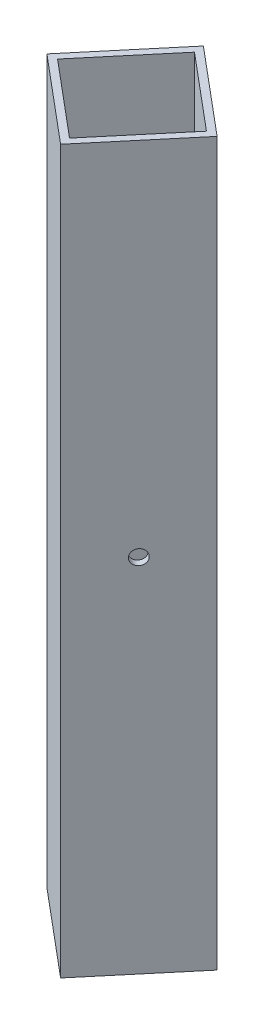
ISO-10303-21;
HEADER;
FILE_DESCRIPTION(('STEP AP214'),'2;1');
FILE_NAME('part.step','',(''),(''),'','','');
FILE_SCHEMA(('AUTOMOTIVE_DESIGN { 1 0 10303 214 1 1 1 1 }'));
ENDSEC;
DATA;
#1=APPLICATION_CONTEXT('core data for automotive mechanical design processes');
#2=APPLICATION_PROTOCOL_DEFINITION('international standard','automotive_design',2000,#1);
#3=PRODUCT_CONTEXT('',#1,'mechanical');
#4=PRODUCT('Part','Part','',(#3));
#5=PRODUCT_RELATED_PRODUCT_CATEGORY('part','',(#4));
#6=PRODUCT_DEFINITION_FORMATION('','',#4);
#7=PRODUCT_DEFINITION_CONTEXT('part definition',#1,'design');
#8=PRODUCT_DEFINITION('design','',#6,#7);
#9=PRODUCT_DEFINITION_SHAPE('','',#8);
#10=(LENGTH_UNIT() NAMED_UNIT(*) SI_UNIT(.MILLI.,.METRE.));
#11=(NAMED_UNIT(*) PLANE_ANGLE_UNIT() SI_UNIT($,.RADIAN.));
#12=(NAMED_UNIT(*) SI_UNIT($,.STERADIAN.) SOLID_ANGLE_UNIT());
#13=UNCERTAINTY_MEASURE_WITH_UNIT(LENGTH_MEASURE(1.E-05),#10,'distance_accuracy_value','');
#14=(GEOMETRIC_REPRESENTATION_CONTEXT(3) GLOBAL_UNCERTAINTY_ASSIGNED_CONTEXT((#13)) GLOBAL_UNIT_ASSIGNED_CONTEXT((#10,
#11,#12)) REPRESENTATION_CONTEXT('',''));
#15=CARTESIAN_POINT('',(0.,0.,0.));
#16=DIRECTION('',(0.,0.,1.));
#17=DIRECTION('',(1.,0.,0.));
#18=AXIS2_PLACEMENT_3D('',#15,#16,#17);
#19=CARTESIAN_POINT('',(360.587988116179,165.1,295.999551887389));
#20=DIRECTION('',(0.64278760968654,0.,-0.766044443118978));
#21=DIRECTION('',(-0.766044443118978,0.,-0.64278760968654));
#22=AXIS2_PLACEMENT_3D('',#19,#20,#21);
#23=PLANE('',#22);
#24=DIRECTION('',(0.766044443118978,0.,0.64278760968654));
#25=VECTOR('',#24,1.);
#26=CARTESIAN_POINT('',(360.587988116179,-165.1,295.999551887389));
#27=LINE('',#26,#25);
#28=CARTESIAN_POINT('',(987.787862844886,-165.1,822.282735446684));
#29=VERTEX_POINT('',#28);
#30=CARTESIAN_POINT('',(1026.70292055533,-165.1,854.93634601876));
#31=VERTEX_POINT('',#30);
#32=EDGE_CURVE('E157',#29,#31,#27,.T.);
#33=ORIENTED_EDGE('',*,*,#32,.F.);
#34=DIRECTION('',(0.,-1.,0.));
#35=VECTOR('',#34,1.);
#36=CARTESIAN_POINT('',(987.787862844886,165.1,822.282735446684));
#37=LINE('',#36,#35);
#38=CARTESIAN_POINT('',(987.787862844886,165.1,822.282735446684));
#39=VERTEX_POINT('',#38);
#40=EDGE_CURVE('E9',#39,#29,#37,.T.);
#41=ORIENTED_EDGE('',*,*,#40,.F.);
#42=DIRECTION('',(0.766044443118978,0.,0.64278760968654));
#43=VECTOR('',#42,1.);
#44=CARTESIAN_POINT('',(360.587988116179,165.1,295.999551887389));
#45=LINE('',#44,#43);
#46=CARTESIAN_POINT('',(1026.70292055533,165.1,854.93634601876));
#47=VERTEX_POINT('',#46);
#48=EDGE_CURVE('E117',#39,#47,#45,.T.);
#49=ORIENTED_EDGE('',*,*,#48,.T.);
#50=DIRECTION('',(0.,-1.,0.));
#51=VECTOR('',#50,1.);
#52=CARTESIAN_POINT('',(1026.70292055533,165.1,854.93634601876));
#53=LINE('',#52,#51);
#54=EDGE_CURVE('E82',#47,#31,#53,.T.);
#55=ORIENTED_EDGE('',*,*,#54,.T.);
#56=EDGE_LOOP('',(#33,#41,#49,#55));
#57=FACE_BOUND('',#56,.T.);
#58=ADVANCED_FACE('F14',(#57),#23,.T.);
#59=CARTESIAN_POINT('',(965.570417164201,165.1,848.760456154906));
#60=DIRECTION('',(0.766044443118978,0.,0.64278760968654));
#61=DIRECTION('',(0.64278760968654,0.,-0.766044443118978));
#62=AXIS2_PLACEMENT_3D('',#59,#60,#61);
#63=PLANE('',#62);
#64=CARTESIAN_POINT('',(971.461057558848,0.,841.740264301906));
#65=DIRECTION('',(-0.766044443118978,0.,-0.64278760968654));
#66=DIRECTION('',(-0.64278760968654,0.,0.766044443118978));
#67=AXIS2_PLACEMENT_3D('',#64,#65,#66);
#68=CIRCLE('',#67,3.37820000000011);
#69=CARTESIAN_POINT('',(969.289592455805,0.,844.328115639651));
#70=VERTEX_POINT('',#69);
#71=EDGE_CURVE('E259',#70,#70,#68,.T.);
#72=ORIENTED_EDGE('',*,*,#71,.F.);
#73=EDGE_LOOP('',(#72));
#74=FACE_BOUND('',#73,.T.);
#75=DIRECTION('',(-0.64278760968654,0.,0.766044443118978));
#76=VECTOR('',#75,1.);
#77=CARTESIAN_POINT('',(965.570417164201,-165.1,848.760456154906));
#78=LINE('',#77,#76);
#79=CARTESIAN_POINT('',(955.134252272809,-165.1,861.197793157127));
#80=VERTEX_POINT('',#79);
#81=EDGE_CURVE('E124',#29,#80,#78,.T.);
#82=ORIENTED_EDGE('',*,*,#81,.T.);
#83=DIRECTION('',(0.,-1.,0.));
#84=VECTOR('',#83,1.);
#85=CARTESIAN_POINT('',(955.134252272809,165.1,861.197793157127));
#86=LINE('',#85,#84);
#87=CARTESIAN_POINT('',(955.134252272809,165.1,861.197793157127));
#88=VERTEX_POINT('',#87);
#89=EDGE_CURVE('E25',#88,#80,#86,.T.);
#90=ORIENTED_EDGE('',*,*,#89,.F.);
#91=DIRECTION('',(-0.64278760968654,0.,0.766044443118978));
#92=VECTOR('',#91,1.);
#93=CARTESIAN_POINT('',(965.570417164201,165.1,848.760456154906));
#94=LINE('',#93,#92);
#95=EDGE_CURVE('E112',#39,#88,#94,.T.);
#96=ORIENTED_EDGE('',*,*,#95,.F.);
#97=ORIENTED_EDGE('',*,*,#40,.T.);
#98=EDGE_LOOP('',(#82,#90,#96,#97));
#99=FACE_BOUND('',#98,.T.);
#100=ADVANCED_FACE('F122',(#74,#99),#63,.F.);
#101=CARTESIAN_POINT('',(278.112903575089,165.1,293.109429165724));
#102=DIRECTION('',(-0.64278760968654,0.,0.766044443118978));
#103=DIRECTION('',(0.766044443118978,0.,0.64278760968654));
#104=AXIS2_PLACEMENT_3D('',#101,#102,#103);
#105=PLANE('',#104);
#106=DIRECTION('',(-0.766044443118978,0.,-0.64278760968654));
#107=VECTOR('',#106,1.);
#108=CARTESIAN_POINT('',(278.112903575089,-165.1,293.109429165724));
#109=LINE('',#108,#107);
#110=CARTESIAN_POINT('',(994.049309983253,-165.1,893.851403729204));
#111=VERTEX_POINT('',#110);
#112=EDGE_CURVE('E163',#111,#80,#109,.T.);
#113=ORIENTED_EDGE('',*,*,#112,.F.);
#114=DIRECTION('',(0.,-1.,0.));
#115=VECTOR('',#114,1.);
#116=CARTESIAN_POINT('',(994.049309983253,165.1,893.851403729204));
#117=LINE('',#116,#115);
#118=CARTESIAN_POINT('',(994.049309983253,165.1,893.851403729204));
#119=VERTEX_POINT('',#118);
#120=EDGE_CURVE('E74',#119,#111,#117,.T.);
#121=ORIENTED_EDGE('',*,*,#120,.F.);
#122=DIRECTION('',(-0.766044443118978,0.,-0.64278760968654));
#123=VECTOR('',#122,1.);
#124=CARTESIAN_POINT('',(278.112903575089,165.1,293.109429165724));
#125=LINE('',#124,#123);
#126=EDGE_CURVE('E116',#119,#88,#125,.T.);
#127=ORIENTED_EDGE('',*,*,#126,.T.);
#128=ORIENTED_EDGE('',*,*,#89,.T.);
#129=EDGE_LOOP('',(#113,#121,#127,#128));
#130=FACE_BOUND('',#129,.T.);
#131=ADVANCED_FACE('F130',(#130),#105,.T.);
#132=CARTESIAN_POINT('',(1002.44079281438,165.1,878.911400767734));
#133=DIRECTION('',(-0.766044443118978,0.,-0.64278760968654));
#134=DIRECTION('',(-0.64278760968654,0.,0.766044443118978));
#135=AXIS2_PLACEMENT_3D('',#132,#133,#134);
#136=PLANE('',#135);
#137=CARTESIAN_POINT('',(1007.94392416239,0.,872.353024213227));
#138=DIRECTION('',(-0.766044443118978,0.,-0.64278760968654));
#139=DIRECTION('',(-0.64278760968654,0.,0.766044443118978));
#140=AXIS2_PLACEMENT_3D('',#137,#138,#139);
#141=CIRCLE('',#140,3.3782);
#142=CARTESIAN_POINT('',(1005.77245905935,0.,874.940875550972));
#143=VERTEX_POINT('',#142);
#144=EDGE_CURVE('E146',#143,#143,#141,.F.);
#145=ORIENTED_EDGE('',*,*,#144,.T.);
#146=EDGE_LOOP('',(#145));
#147=FACE_BOUND('',#146,.T.);
#148=DIRECTION('',(0.64278760968654,0.,-0.766044443118978));
#149=VECTOR('',#148,1.);
#150=CARTESIAN_POINT('',(1002.44079281438,-165.1,878.911400767734));
#151=LINE('',#150,#149);
#152=CARTESIAN_POINT('',(993.657969537106,-165.1,889.378361961546));
#153=VERTEX_POINT('',#152);
#154=CARTESIAN_POINT('',(1022.22987878767,-165.1,855.327686464908));
#155=VERTEX_POINT('',#154);
#156=EDGE_CURVE('E141',#153,#155,#151,.T.);
#157=ORIENTED_EDGE('',*,*,#156,.F.);
#158=DIRECTION('',(0.,-1.,0.));
#159=VECTOR('',#158,1.);
#160=CARTESIAN_POINT('',(993.657969537106,165.1,889.378361961546));
#161=LINE('',#160,#159);
#162=CARTESIAN_POINT('',(993.657969537106,165.1,889.378361961546));
#163=VERTEX_POINT('',#162);
#164=EDGE_CURVE('E91',#163,#153,#161,.T.);
#165=ORIENTED_EDGE('',*,*,#164,.F.);
#166=DIRECTION('',(0.64278760968654,0.,-0.766044443118978));
#167=VECTOR('',#166,1.);
#168=CARTESIAN_POINT('',(1002.44079281438,165.1,878.911400767734));
#169=LINE('',#168,#167);
#170=CARTESIAN_POINT('',(1022.22987878767,165.1,855.327686464908));
#171=VERTEX_POINT('',#170);
#172=EDGE_CURVE('E168',#163,#171,#169,.T.);
#173=ORIENTED_EDGE('',*,*,#172,.T.);
#174=DIRECTION('',(0.,-1.,0.));
#175=VECTOR('',#174,1.);
#176=CARTESIAN_POINT('',(1022.22987878767,165.1,855.327686464908));
#177=LINE('',#176,#175);
#178=EDGE_CURVE('E137',#171,#155,#177,.T.);
#179=ORIENTED_EDGE('',*,*,#178,.T.);
#180=EDGE_LOOP('',(#157,#165,#173,#179));
#181=FACE_BOUND('',#180,.T.);
#182=ADVANCED_FACE('F16',(#147,#181),#136,.T.);
#183=CARTESIAN_POINT('',(754.755398596091,165.1,688.915302797637));
#184=DIRECTION('',(0.64278760968654,0.,-0.766044443118978));
#185=DIRECTION('',(-0.766044443118978,0.,-0.64278760968654));
#186=AXIS2_PLACEMENT_3D('',#183,#184,#185);
#187=PLANE('',#186);
#188=DIRECTION('',(0.766044443118978,0.,0.64278760968654));
#189=VECTOR('',#188,1.);
#190=CARTESIAN_POINT('',(754.755398596091,-165.1,688.915302797637));
#191=LINE('',#190,#189);
#192=CARTESIAN_POINT('',(959.607294040467,-165.1,860.80645271098));
#193=VERTEX_POINT('',#192);
#194=EDGE_CURVE('E145',#193,#153,#191,.T.);
#195=ORIENTED_EDGE('',*,*,#194,.F.);
#196=DIRECTION('',(0.,-1.,0.));
#197=VECTOR('',#196,1.);
#198=CARTESIAN_POINT('',(959.607294040467,165.1,860.80645271098));
#199=LINE('',#198,#197);
#200=CARTESIAN_POINT('',(959.607294040467,165.1,860.80645271098));
#201=VERTEX_POINT('',#200);
#202=EDGE_CURVE('E178',#201,#193,#199,.T.);
#203=ORIENTED_EDGE('',*,*,#202,.F.);
#204=DIRECTION('',(0.766044443118978,0.,0.64278760968654));
#205=VECTOR('',#204,1.);
#206=CARTESIAN_POINT('',(754.755398596091,165.1,688.915302797637));
#207=LINE('',#206,#205);
#208=EDGE_CURVE('E187',#201,#163,#207,.T.);
#209=ORIENTED_EDGE('',*,*,#208,.T.);
#210=ORIENTED_EDGE('',*,*,#164,.T.);
#211=EDGE_LOOP('',(#195,#203,#209,#210));
#212=FACE_BOUND('',#211,.T.);
#213=ADVANCED_FACE('F185',(#212),#187,.T.);
#214=CARTESIAN_POINT('',(968.002608271104,165.1,850.80130681566));
#215=DIRECTION('',(0.766044443118978,0.,0.64278760968654));
#216=DIRECTION('',(0.64278760968654,0.,-0.766044443118978));
#217=AXIS2_PLACEMENT_3D('',#214,#215,#216);
#218=PLANE('',#217);
#219=CARTESIAN_POINT('',(973.89324866575,0.,843.78111496266));
#220=DIRECTION('',(0.766044443118978,0.,0.64278760968654));
#221=DIRECTION('',(0.64278760968654,0.,-0.766044443118978));
#222=AXIS2_PLACEMENT_3D('',#219,#220,#221);
#223=CIRCLE('',#222,3.3782);
#224=CARTESIAN_POINT('',(976.064713768793,0.,841.193263624915));
#225=VERTEX_POINT('',#224);
#226=EDGE_CURVE('E252',#225,#225,#223,.F.);
#227=ORIENTED_EDGE('',*,*,#226,.T.);
#228=EDGE_LOOP('',(#227));
#229=FACE_BOUND('',#228,.T.);
#230=DIRECTION('',(-0.64278760968654,0.,0.766044443118978));
#231=VECTOR('',#230,1.);
#232=CARTESIAN_POINT('',(968.002608271104,-165.1,850.80130681566));
#233=LINE('',#232,#231);
#234=CARTESIAN_POINT('',(988.179203291034,-165.1,826.755777214341));
#235=VERTEX_POINT('',#234);
#236=EDGE_CURVE('E149',#235,#193,#233,.T.);
#237=ORIENTED_EDGE('',*,*,#236,.F.);
#238=DIRECTION('',(0.,-1.,0.));
#239=VECTOR('',#238,1.);
#240=CARTESIAN_POINT('',(988.179203291034,165.1,826.755777214341));
#241=LINE('',#240,#239);
#242=CARTESIAN_POINT('',(988.179203291034,165.1,826.755777214341));
#243=VERTEX_POINT('',#242);
#244=EDGE_CURVE('E175',#243,#235,#241,.T.);
#245=ORIENTED_EDGE('',*,*,#244,.F.);
#246=DIRECTION('',(-0.64278760968654,0.,0.766044443118978));
#247=VECTOR('',#246,1.);
#248=CARTESIAN_POINT('',(968.002608271104,165.1,850.80130681566));
#249=LINE('',#248,#247);
#250=EDGE_CURVE('E197',#243,#201,#249,.T.);
#251=ORIENTED_EDGE('',*,*,#250,.T.);
#252=ORIENTED_EDGE('',*,*,#202,.T.);
#253=EDGE_LOOP('',(#237,#245,#251,#252));
#254=FACE_BOUND('',#253,.T.);
#255=ADVANCED_FACE('F194',(#229,#254),#218,.T.);
#256=CARTESIAN_POINT('',(783.331583493842,165.1,654.868214994973));
#257=DIRECTION('',(-0.64278760968654,0.,0.766044443118978));
#258=DIRECTION('',(0.766044443118978,0.,0.64278760968654));
#259=AXIS2_PLACEMENT_3D('',#256,#257,#258);
#260=PLANE('',#259);
#261=DIRECTION('',(-0.766044443118978,0.,-0.64278760968654));
#262=VECTOR('',#261,1.);
#263=CARTESIAN_POINT('',(783.331583493842,-165.1,654.868214994973));
#264=LINE('',#263,#262);
#265=EDGE_CURVE('E153',#155,#235,#264,.T.);
#266=ORIENTED_EDGE('',*,*,#265,.F.);
#267=ORIENTED_EDGE('',*,*,#178,.F.);
#268=DIRECTION('',(-0.766044443118978,0.,-0.64278760968654));
#269=VECTOR('',#268,1.);
#270=CARTESIAN_POINT('',(783.331583493842,165.1,654.868214994973));
#271=LINE('',#270,#269);
#272=EDGE_CURVE('E205',#171,#243,#271,.T.);
#273=ORIENTED_EDGE('',*,*,#272,.T.);
#274=ORIENTED_EDGE('',*,*,#244,.T.);
#275=EDGE_LOOP('',(#266,#267,#273,#274));
#276=FACE_BOUND('',#275,.T.);
#277=ADVANCED_FACE('F216',(#276),#260,.T.);
#278=CARTESIAN_POINT('',(1004.87298392128,165.1,880.952251428489));
#279=DIRECTION('',(-0.766044443118978,0.,-0.64278760968654));
#280=DIRECTION('',(-0.64278760968654,0.,0.766044443118978));
#281=AXIS2_PLACEMENT_3D('',#278,#279,#280);
#282=PLANE('',#281);
#283=CARTESIAN_POINT('',(1010.37611526929,0.,874.393874873982));
#284=DIRECTION('',(-0.766044443118978,0.,-0.64278760968654));
#285=DIRECTION('',(-0.64278760968654,0.,0.766044443118978));
#286=AXIS2_PLACEMENT_3D('',#283,#284,#285);
#287=CIRCLE('',#286,3.3782);
#288=CARTESIAN_POINT('',(1008.20465016625,0.,876.981726211727));
#289=VERTEX_POINT('',#288);
#290=EDGE_CURVE('E18',#289,#289,#287,.F.);
#291=ORIENTED_EDGE('',*,*,#290,.F.);
#292=EDGE_LOOP('',(#291));
#293=FACE_BOUND('',#292,.T.);
#294=DIRECTION('',(0.64278760968654,0.,-0.766044443118978));
#295=VECTOR('',#294,1.);
#296=CARTESIAN_POINT('',(1004.87298392128,-165.1,880.952251428489));
#297=LINE('',#296,#295);
#298=EDGE_CURVE('E165',#111,#31,#297,.T.);
#299=ORIENTED_EDGE('',*,*,#298,.T.);
#300=ORIENTED_EDGE('',*,*,#54,.F.);
#301=DIRECTION('',(0.64278760968654,0.,-0.766044443118978));
#302=VECTOR('',#301,1.);
#303=CARTESIAN_POINT('',(1004.87298392128,165.1,880.952251428489));
#304=LINE('',#303,#302);
#305=EDGE_CURVE('E39',#119,#47,#304,.T.);
#306=ORIENTED_EDGE('',*,*,#305,.F.);
#307=ORIENTED_EDGE('',*,*,#120,.T.);
#308=EDGE_LOOP('',(#299,#300,#306,#307));
#309=FACE_BOUND('',#308,.T.);
#310=ADVANCED_FACE('F214',(#293,#309),#282,.F.);
#311=CARTESIAN_POINT('',(705.053366952356,165.1,637.655198226429));
#312=DIRECTION('',(0.,1.,0.));
#313=DIRECTION('',(-1.,0.,0.));
#314=AXIS2_PLACEMENT_3D('',#311,#312,#313);
#315=PLANE('',#314);
#316=ORIENTED_EDGE('',*,*,#172,.F.);
#317=ORIENTED_EDGE('',*,*,#208,.F.);
#318=ORIENTED_EDGE('',*,*,#250,.F.);
#319=ORIENTED_EDGE('',*,*,#272,.F.);
#320=EDGE_LOOP('',(#316,#317,#318,#319));
#321=FACE_BOUND('',#320,.T.);
#322=ORIENTED_EDGE('',*,*,#48,.F.);
#323=ORIENTED_EDGE('',*,*,#95,.T.);
#324=ORIENTED_EDGE('',*,*,#126,.F.);
#325=ORIENTED_EDGE('',*,*,#305,.T.);
#326=EDGE_LOOP('',(#322,#323,#324,#325));
#327=FACE_BOUND('',#326,.T.);
#328=ADVANCED_FACE('F114',(#321,#327),#315,.T.);
#329=CARTESIAN_POINT('',(705.053366952356,-165.1,637.655198226429));
#330=DIRECTION('',(0.,1.,0.));
#331=DIRECTION('',(-1.,0.,0.));
#332=AXIS2_PLACEMENT_3D('',#329,#330,#331);
#333=PLANE('',#332);
#334=ORIENTED_EDGE('',*,*,#156,.T.);
#335=ORIENTED_EDGE('',*,*,#265,.T.);
#336=ORIENTED_EDGE('',*,*,#236,.T.);
#337=ORIENTED_EDGE('',*,*,#194,.T.);
#338=EDGE_LOOP('',(#334,#335,#336,#337));
#339=FACE_BOUND('',#338,.T.);
#340=ORIENTED_EDGE('',*,*,#32,.T.);
#341=ORIENTED_EDGE('',*,*,#298,.F.);
#342=ORIENTED_EDGE('',*,*,#112,.T.);
#343=ORIENTED_EDGE('',*,*,#81,.F.);
#344=EDGE_LOOP('',(#340,#341,#342,#343));
#345=FACE_BOUND('',#344,.T.);
#346=ADVANCED_FACE('F190',(#339,#345),#333,.F.);
#347=CARTESIAN_POINT('',(1236.80258432085,0.,1064.38824154392));
#348=DIRECTION('',(-0.766044443118978,0.,-0.64278760968654));
#349=DIRECTION('',(-0.64278760968654,0.,0.766044443118978));
#350=AXIS2_PLACEMENT_3D('',#347,#348,#349);
#351=CYLINDRICAL_SURFACE('',#350,3.3782);
#352=ORIENTED_EDGE('',*,*,#144,.F.);
#353=EDGE_LOOP('',(#352));
#354=FACE_BOUND('',#353,.T.);
#355=ORIENTED_EDGE('',*,*,#290,.T.);
#356=EDGE_LOOP('',(#355));
#357=FACE_BOUND('',#356,.T.);
#358=ADVANCED_FACE('F272',(#354,#357),#351,.F.);
#359=ORIENTED_EDGE('',*,*,#226,.F.);
#360=EDGE_LOOP('',(#359));
#361=FACE_BOUND('',#360,.T.);
#362=ORIENTED_EDGE('',*,*,#71,.T.);
#363=EDGE_LOOP('',(#362));
#364=FACE_BOUND('',#363,.T.);
#365=ADVANCED_FACE('F274',(#361,#364),#351,.F.);
#366=CLOSED_SHELL('',(#58,#100,#131,#182,#213,#255,#277,#310,#328,#346,#358,#365));
#367=MANIFOLD_SOLID_BREP('B1',#366);
#368=ADVANCED_BREP_SHAPE_REPRESENTATION('',(#18,#367),#14);
#369=SHAPE_DEFINITION_REPRESENTATION(#9,#368);
ENDSEC;
END-ISO-10303-21;
